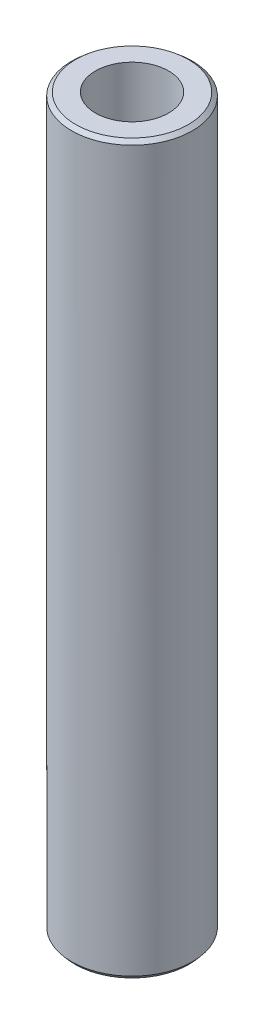
ISO-10303-21;
HEADER;
FILE_DESCRIPTION(('STEP AP214'),'2;1');
FILE_NAME('part.step','',(''),(''),'','','');
FILE_SCHEMA(('AUTOMOTIVE_DESIGN { 1 0 10303 214 1 1 1 1 }'));
ENDSEC;
DATA;
#1=APPLICATION_CONTEXT('core data for automotive mechanical design processes');
#2=APPLICATION_PROTOCOL_DEFINITION('international standard','automotive_design',2000,#1);
#3=PRODUCT_CONTEXT('',#1,'mechanical');
#4=PRODUCT('Part','Part','',(#3));
#5=PRODUCT_RELATED_PRODUCT_CATEGORY('part','',(#4));
#6=PRODUCT_DEFINITION_FORMATION('','',#4);
#7=PRODUCT_DEFINITION_CONTEXT('part definition',#1,'design');
#8=PRODUCT_DEFINITION('design','',#6,#7);
#9=PRODUCT_DEFINITION_SHAPE('','',#8);
#10=(LENGTH_UNIT() NAMED_UNIT(*) SI_UNIT(.MILLI.,.METRE.));
#11=(NAMED_UNIT(*) PLANE_ANGLE_UNIT() SI_UNIT($,.RADIAN.));
#12=(NAMED_UNIT(*) SI_UNIT($,.STERADIAN.) SOLID_ANGLE_UNIT());
#13=UNCERTAINTY_MEASURE_WITH_UNIT(LENGTH_MEASURE(1.E-05),#10,'distance_accuracy_value','');
#14=(GEOMETRIC_REPRESENTATION_CONTEXT(3) GLOBAL_UNCERTAINTY_ASSIGNED_CONTEXT((#13)) GLOBAL_UNIT_ASSIGNED_CONTEXT((#10,
#11,#12)) REPRESENTATION_CONTEXT('',''));
#15=CARTESIAN_POINT('',(0.,0.,0.));
#16=DIRECTION('',(0.,0.,1.));
#17=DIRECTION('',(1.,0.,0.));
#18=AXIS2_PLACEMENT_3D('',#15,#16,#17);
#19=CARTESIAN_POINT('',(0.,150.466788725705,0.));
#20=DIRECTION('',(0.,-1.,0.));
#21=DIRECTION('',(0.,0.,-1.));
#22=AXIS2_PLACEMENT_3D('',#19,#20,#21);
#23=CYLINDRICAL_SURFACE('',#22,12.5);
#24=CARTESIAN_POINT('',(0.,149.759461627095,0.));
#25=DIRECTION('',(0.,1.,0.));
#26=DIRECTION('',(0.,0.,1.));
#27=AXIS2_PLACEMENT_3D('',#24,#25,#26);
#28=CIRCLE('',#27,12.5);
#29=CARTESIAN_POINT('',(0.,149.759461627095,-12.5));
#30=VERTEX_POINT('',#29);
#31=EDGE_CURVE('E50',#30,#30,#28,.F.);
#32=ORIENTED_EDGE('',*,*,#31,.T.);
#33=EDGE_LOOP('',(#32));
#34=FACE_BOUND('',#33,.T.);
#35=CARTESIAN_POINT('',(0.,0.82992635058321,0.));
#36=DIRECTION('',(0.,1.,0.));
#37=DIRECTION('',(0.,0.,1.));
#38=AXIS2_PLACEMENT_3D('',#35,#36,#37);
#39=CIRCLE('',#38,12.5);
#40=CARTESIAN_POINT('',(0.,0.82992635058321,12.5));
#41=VERTEX_POINT('',#40);
#42=EDGE_CURVE('E51',#41,#41,#39,.T.);
#43=ORIENTED_EDGE('',*,*,#42,.T.);
#44=EDGE_LOOP('',(#43));
#45=FACE_BOUND('',#44,.T.);
#46=ADVANCED_FACE('F39',(#34,#45),#23,.T.);
#47=CARTESIAN_POINT('',(0.,150.466788725705,0.));
#48=DIRECTION('',(0.,1.,0.));
#49=DIRECTION('',(0.,0.,1.));
#50=AXIS2_PLACEMENT_3D('',#47,#48,#49);
#51=PLANE('',#50);
#52=CARTESIAN_POINT('',(0.,150.466788725705,0.));
#53=DIRECTION('',(0.,1.,0.));
#54=DIRECTION('',(0.,0.,1.));
#55=AXIS2_PLACEMENT_3D('',#52,#53,#54);
#56=CIRCLE('',#55,11.6700736494168);
#57=CARTESIAN_POINT('',(0.,150.466788725705,-11.6700736494168));
#58=VERTEX_POINT('',#57);
#59=EDGE_CURVE('E54',#58,#58,#56,.T.);
#60=ORIENTED_EDGE('',*,*,#59,.T.);
#61=EDGE_LOOP('',(#60));
#62=FACE_BOUND('',#61,.T.);
#63=CARTESIAN_POINT('',(0.,150.466788725705,0.));
#64=DIRECTION('',(0.,1.,0.));
#65=DIRECTION('',(0.,0.,1.));
#66=AXIS2_PLACEMENT_3D('',#63,#64,#65);
#67=CIRCLE('',#66,7.56721321047751);
#68=CARTESIAN_POINT('',(0.,150.466788725705,7.56721321047751));
#69=VERTEX_POINT('',#68);
#70=EDGE_CURVE('E58',#69,#69,#67,.T.);
#71=ORIENTED_EDGE('',*,*,#70,.F.);
#72=EDGE_LOOP('',(#71));
#73=FACE_BOUND('',#72,.T.);
#74=ADVANCED_FACE('F69',(#62,#73),#51,.T.);
#75=CARTESIAN_POINT('',(0.,0.,0.));
#76=DIRECTION('',(0.,1.,0.));
#77=DIRECTION('',(0.,0.,1.));
#78=AXIS2_PLACEMENT_3D('',#75,#76,#77);
#79=PLANE('',#78);
#80=CARTESIAN_POINT('',(0.,0.,0.));
#81=DIRECTION('',(0.,1.,0.));
#82=DIRECTION('',(0.,0.,1.));
#83=AXIS2_PLACEMENT_3D('',#80,#81,#82);
#84=CIRCLE('',#83,11.79267290139);
#85=CARTESIAN_POINT('',(0.,0.,11.79267290139));
#86=VERTEX_POINT('',#85);
#87=EDGE_CURVE('E10',#86,#86,#84,.F.);
#88=ORIENTED_EDGE('',*,*,#87,.T.);
#89=EDGE_LOOP('',(#88));
#90=FACE_BOUND('',#89,.T.);
#91=CARTESIAN_POINT('',(0.,0.,0.));
#92=DIRECTION('',(0.,1.,0.));
#93=DIRECTION('',(0.,0.,1.));
#94=AXIS2_PLACEMENT_3D('',#91,#92,#93);
#95=CIRCLE('',#94,7.56721321047751);
#96=CARTESIAN_POINT('',(0.,0.,7.56721321047751));
#97=VERTEX_POINT('',#96);
#98=EDGE_CURVE('E63',#97,#97,#95,.T.);
#99=ORIENTED_EDGE('',*,*,#98,.T.);
#100=EDGE_LOOP('',(#99));
#101=FACE_BOUND('',#100,.T.);
#102=ADVANCED_FACE('F75',(#90,#101),#79,.F.);
#103=CARTESIAN_POINT('',(0.,150.466788725705,0.));
#104=DIRECTION('',(0.,-1.,0.));
#105=DIRECTION('',(0.,0.,-1.));
#106=AXIS2_PLACEMENT_3D('',#103,#104,#105);
#107=CYLINDRICAL_SURFACE('',#106,7.56721321047751);
#108=ORIENTED_EDGE('',*,*,#70,.T.);
#109=EDGE_LOOP('',(#108));
#110=FACE_BOUND('',#109,.T.);
#111=ORIENTED_EDGE('',*,*,#98,.F.);
#112=EDGE_LOOP('',(#111));
#113=FACE_BOUND('',#112,.T.);
#114=ADVANCED_FACE('F70',(#110,#113),#107,.F.);
#115=CARTESIAN_POINT('',(0.,150.466788725705,0.));
#116=DIRECTION('',(0.,-1.,0.));
#117=DIRECTION('',(0.,0.,-1.));
#118=AXIS2_PLACEMENT_3D('',#115,#116,#117);
#119=CONICAL_SURFACE('',#118,11.6700736494168,0.864981860269938);
#120=CARTESIAN_POINT('',(0.,149.759461627095,-12.5));
#121=CARTESIAN_POINT('',(0.,149.766829617705,-12.4913549338481));
#122=CARTESIAN_POINT('',(0.,149.774197608316,-12.4827098676962));
#123=CARTESIAN_POINT('',(0.,149.788933589537,-12.4654197353924));
#124=CARTESIAN_POINT('',(0.,149.796301580147,-12.4567746692405));
#125=CARTESIAN_POINT('',(0.,149.811037561368,-12.4394845369367));
#126=CARTESIAN_POINT('',(0.,149.818405551979,-12.4308394707847));
#127=CARTESIAN_POINT('',(0.,149.8331415332,-12.4135493384809));
#128=CARTESIAN_POINT('',(0.,149.84050952381,-12.404904272329));
#129=CARTESIAN_POINT('',(0.,149.855245505031,-12.3876141400252));
#130=CARTESIAN_POINT('',(0.,149.862613495642,-12.3789690738733));
#131=CARTESIAN_POINT('',(0.,149.877349476863,-12.3616789415695));
#132=CARTESIAN_POINT('',(0.,149.884717467473,-12.3530338754176));
#133=CARTESIAN_POINT('',(0.,149.899453448694,-12.3357437431138));
#134=CARTESIAN_POINT('',(0.,149.906821439305,-12.3270986769619));
#135=CARTESIAN_POINT('',(0.,149.921557420526,-12.309808544658));
#136=CARTESIAN_POINT('',(0.,149.928925411137,-12.3011634785061));
#137=CARTESIAN_POINT('',(0.,149.943661392358,-12.2838733462023));
#138=CARTESIAN_POINT('',(0.,149.951029382968,-12.2752282800504));
#139=CARTESIAN_POINT('',(0.,149.965765364189,-12.2579381477466));
#140=CARTESIAN_POINT('',(0.,149.9731333548,-12.2492930815947));
#141=CARTESIAN_POINT('',(0.,149.987869336021,-12.2320029492909));
#142=CARTESIAN_POINT('',(0.,149.995237326631,-12.223357883139));
#143=CARTESIAN_POINT('',(0.,150.009973307852,-12.2060677508351));
#144=CARTESIAN_POINT('',(0.,150.017341298463,-12.1974226846832));
#145=CARTESIAN_POINT('',(0.,150.032077279684,-12.1801325523794));
#146=CARTESIAN_POINT('',(0.,150.039445270294,-12.1714874862275));
#147=CARTESIAN_POINT('',(0.,150.054181251515,-12.1541973539237));
#148=CARTESIAN_POINT('',(0.,150.061549242126,-12.1455522877718));
#149=CARTESIAN_POINT('',(0.,150.076285223347,-12.128262155468));
#150=CARTESIAN_POINT('',(0.,150.083653213957,-12.119617089316));
#151=CARTESIAN_POINT('',(0.,150.098389195178,-12.1023269570122));
#152=CARTESIAN_POINT('',(0.,150.105757185789,-12.0936818908603));
#153=CARTESIAN_POINT('',(0.,150.12049316701,-12.0763917585565));
#154=CARTESIAN_POINT('',(0.,150.127861157621,-12.0677466924046));
#155=CARTESIAN_POINT('',(0.,150.142597138842,-12.0504565601008));
#156=CARTESIAN_POINT('',(0.,150.149965129452,-12.0418114939489));
#157=CARTESIAN_POINT('',(0.,150.164701110673,-12.0245213616451));
#158=CARTESIAN_POINT('',(0.,150.172069101284,-12.0158762954931));
#159=CARTESIAN_POINT('',(0.,150.186805082505,-11.9985861631893));
#160=CARTESIAN_POINT('',(0.,150.194173073115,-11.9899410970374));
#161=CARTESIAN_POINT('',(0.,150.208909054336,-11.9726509647336));
#162=CARTESIAN_POINT('',(0.,150.216277044947,-11.9640058985817));
#163=CARTESIAN_POINT('',(0.,150.231013026168,-11.9467157662779));
#164=CARTESIAN_POINT('',(0.,150.238381016778,-11.938070700126));
#165=CARTESIAN_POINT('',(0.,150.253116997999,-11.9207805678222));
#166=CARTESIAN_POINT('',(0.,150.26048498861,-11.9121355016703));
#167=CARTESIAN_POINT('',(0.,150.275220969831,-11.8948453693664));
#168=CARTESIAN_POINT('',(0.,150.282588960442,-11.8862003032145));
#169=CARTESIAN_POINT('',(0.,150.297324941663,-11.8689101709107));
#170=CARTESIAN_POINT('',(0.,150.304692932273,-11.8602651047588));
#171=CARTESIAN_POINT('',(0.,150.319428913494,-11.842974972455));
#172=CARTESIAN_POINT('',(0.,150.326796904105,-11.8343299063031));
#173=CARTESIAN_POINT('',(0.,150.341532885326,-11.8170397739993));
#174=CARTESIAN_POINT('',(0.,150.348900875936,-11.8083947078474));
#175=CARTESIAN_POINT('',(0.,150.363636857157,-11.7911045755435));
#176=CARTESIAN_POINT('',(0.,150.371004847768,-11.7824595093916));
#177=CARTESIAN_POINT('',(0.,150.385740828989,-11.7651693770878));
#178=CARTESIAN_POINT('',(0.,150.393108819599,-11.7565243109359));
#179=CARTESIAN_POINT('',(0.,150.40784480082,-11.7392341786321));
#180=CARTESIAN_POINT('',(0.,150.415212791431,-11.7305891124802));
#181=CARTESIAN_POINT('',(0.,150.429948772652,-11.7132989801764));
#182=CARTESIAN_POINT('',(0.,150.437316763262,-11.7046539140245));
#183=CARTESIAN_POINT('',(0.,150.452052744484,-11.6873637817206));
#184=CARTESIAN_POINT('',(0.,150.459420735094,-11.6787187155687));
#185=CARTESIAN_POINT('',(0.,150.466788725705,-11.6700736494168));
#186=B_SPLINE_CURVE_WITH_KNOTS('',3,(#120,#121,#122,#123,#124,#125,#126,#127,#128,#129,#130,
#131,#132,#133,#134,#135,#136,#137,#138,#139,#140,#141,#142,#143,#144,#145,#146,#147,#148,#149,
#150,#151,#152,#153,#154,#155,#156,#157,#158,#159,#160,#161,#162,#163,#164,#165,#166,#167,#168,
#169,#170,#171,#172,#173,#174,#175,#176,#177,#178,#179,#180,#181,#182,#183,#184,#185),
.UNSPECIFIED.,.F.,.F.,(4,2,2,2,2,2,2,2,2,2,2,2,2,2,2,2,2,2,2,2,2,2,2,2,2,2,2,2,2,2,2,2,4),(0.,
0.0340766795575501,0.0681533591151015,0.102230038672653,0.136306718230222,0.170383397787774,
0.204460077345324,0.238536756902893,0.272613436460445,0.306690116017996,0.340766795575564,
0.374843475133116,0.408920154690667,0.442996834248236,0.477073513805788,0.511150193363338,
0.545226872920907,0.579303552478459,0.61338023203601,0.64745691159356,0.68153359115113,
0.715610270708681,0.749686950266233,0.783763629823802,0.817840309381352,0.851916988938904,
0.885993668496473,0.920070348054025,0.954147027611575,0.988223707169144,1.0223003867267,
1.05637706628425,1.09045374584182),.UNSPECIFIED.);
#187=EDGE_CURVE('BSEAM81',#30,#58,#186,.T.);
#188=ORIENTED_EDGE('',*,*,#31,.F.);
#189=ORIENTED_EDGE('',*,*,#59,.F.);
#190=ORIENTED_EDGE('',*,*,#187,.T.);
#191=ORIENTED_EDGE('',*,*,#187,.F.);
#192=EDGE_LOOP('',(#188,#190,#189,#191));
#193=FACE_BOUND('',#192,.T.);
#194=ADVANCED_FACE('F81',(#193),#119,.T.);
#195=CARTESIAN_POINT('',(0.,0.82992635058321,0.));
#196=DIRECTION('',(0.,1.,0.));
#197=DIRECTION('',(0.,0.,1.));
#198=AXIS2_PLACEMENT_3D('',#195,#196,#197);
#199=CONICAL_SURFACE('',#198,12.5,0.705814466524954);
#200=ORIENTED_EDGE('',*,*,#87,.F.);
#201=EDGE_LOOP('',(#200));
#202=FACE_BOUND('',#201,.T.);
#203=ORIENTED_EDGE('',*,*,#42,.F.);
#204=EDGE_LOOP('',(#203));
#205=FACE_BOUND('',#204,.T.);
#206=ADVANCED_FACE('F45',(#202,#205),#199,.T.);
#207=CLOSED_SHELL('',(#46,#74,#102,#114,#194,#206));
#208=MANIFOLD_SOLID_BREP('B2',#207);
#209=ADVANCED_BREP_SHAPE_REPRESENTATION('',(#18,#208),#14);
#210=SHAPE_DEFINITION_REPRESENTATION(#9,#209);
ENDSEC;
END-ISO-10303-21;
